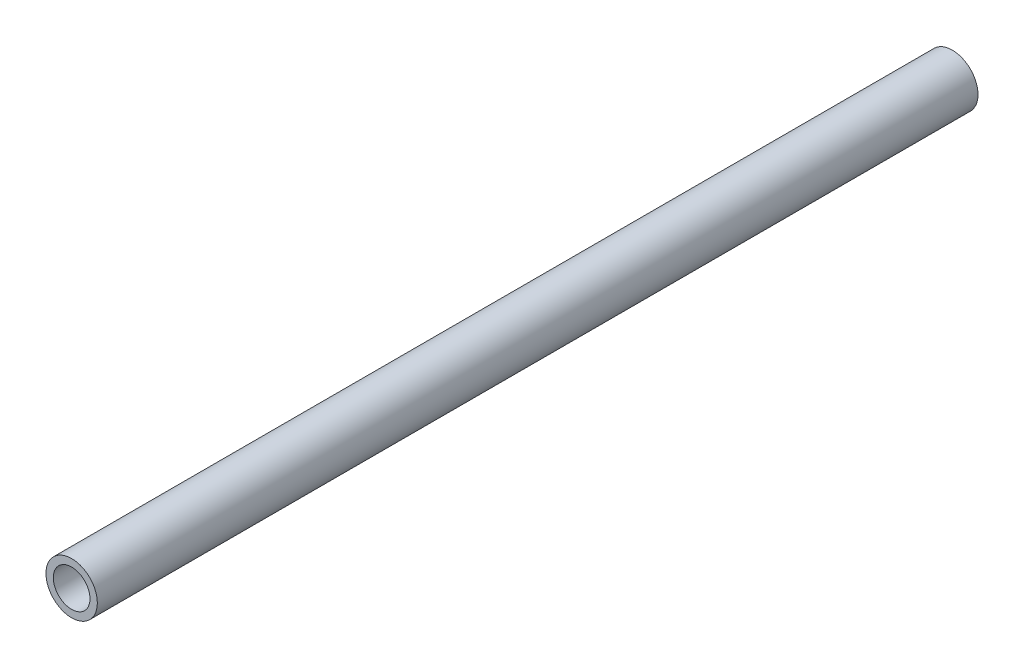
ISO-10303-21;
HEADER;
FILE_DESCRIPTION(('STEP AP214'),'2;1');
FILE_NAME('part.step','',(''),(''),'','','');
FILE_SCHEMA(('AUTOMOTIVE_DESIGN { 1 0 10303 214 1 1 1 1 }'));
ENDSEC;
DATA;
#1=APPLICATION_CONTEXT('core data for automotive mechanical design processes');
#2=APPLICATION_PROTOCOL_DEFINITION('international standard','automotive_design',2000,#1);
#3=PRODUCT_CONTEXT('',#1,'mechanical');
#4=PRODUCT('Part','Part','',(#3));
#5=PRODUCT_RELATED_PRODUCT_CATEGORY('part','',(#4));
#6=PRODUCT_DEFINITION_FORMATION('','',#4);
#7=PRODUCT_DEFINITION_CONTEXT('part definition',#1,'design');
#8=PRODUCT_DEFINITION('design','',#6,#7);
#9=PRODUCT_DEFINITION_SHAPE('','',#8);
#10=(LENGTH_UNIT() NAMED_UNIT(*) SI_UNIT(.MILLI.,.METRE.));
#11=(NAMED_UNIT(*) PLANE_ANGLE_UNIT() SI_UNIT($,.RADIAN.));
#12=(NAMED_UNIT(*) SI_UNIT($,.STERADIAN.) SOLID_ANGLE_UNIT());
#13=UNCERTAINTY_MEASURE_WITH_UNIT(LENGTH_MEASURE(1.E-05),#10,'distance_accuracy_value','');
#14=(GEOMETRIC_REPRESENTATION_CONTEXT(3) GLOBAL_UNCERTAINTY_ASSIGNED_CONTEXT((#13)) GLOBAL_UNIT_ASSIGNED_CONTEXT((#10,
#11,#12)) REPRESENTATION_CONTEXT('',''));
#15=CARTESIAN_POINT('',(0.,0.,0.));
#16=DIRECTION('',(0.,0.,1.));
#17=DIRECTION('',(1.,0.,0.));
#18=AXIS2_PLACEMENT_3D('',#15,#16,#17);
#19=CARTESIAN_POINT('',(0.,0.,457.2));
#20=DIRECTION('',(0.,0.,-1.));
#21=DIRECTION('',(-1.,0.,0.));
#22=AXIS2_PLACEMENT_3D('',#19,#20,#21);
#23=CYLINDRICAL_SURFACE('',#22,13.335);
#24=CARTESIAN_POINT('',(0.,0.,457.2));
#25=DIRECTION('',(0.,0.,1.));
#26=DIRECTION('',(1.,0.,0.));
#27=AXIS2_PLACEMENT_3D('',#24,#25,#26);
#28=CIRCLE('',#27,13.335);
#29=CARTESIAN_POINT('',(13.335,0.,457.2));
#30=VERTEX_POINT('',#29);
#31=EDGE_CURVE('E10',#30,#30,#28,.T.);
#32=ORIENTED_EDGE('',*,*,#31,.F.);
#33=EDGE_LOOP('',(#32));
#34=FACE_BOUND('',#33,.T.);
#35=CARTESIAN_POINT('',(0.,0.,0.));
#36=DIRECTION('',(0.,0.,1.));
#37=DIRECTION('',(1.,0.,0.));
#38=AXIS2_PLACEMENT_3D('',#35,#36,#37);
#39=CIRCLE('',#38,13.335);
#40=CARTESIAN_POINT('',(13.335,0.,0.));
#41=VERTEX_POINT('',#40);
#42=EDGE_CURVE('E34',#41,#41,#39,.T.);
#43=ORIENTED_EDGE('',*,*,#42,.T.);
#44=EDGE_LOOP('',(#43));
#45=FACE_BOUND('',#44,.T.);
#46=ADVANCED_FACE('F31',(#34,#45),#23,.T.);
#47=CARTESIAN_POINT('',(0.,0.,457.2));
#48=DIRECTION('',(0.,0.,1.));
#49=DIRECTION('',(1.,0.,0.));
#50=AXIS2_PLACEMENT_3D('',#47,#48,#49);
#51=PLANE('',#50);
#52=CARTESIAN_POINT('',(0.,0.,457.2));
#53=DIRECTION('',(0.,0.,-1.));
#54=DIRECTION('',(-1.,0.,0.));
#55=AXIS2_PLACEMENT_3D('',#52,#53,#54);
#56=CIRCLE('',#55,9.525);
#57=CARTESIAN_POINT('',(-9.525,0.,457.2));
#58=VERTEX_POINT('',#57);
#59=EDGE_CURVE('E41',#58,#58,#56,.T.);
#60=ORIENTED_EDGE('',*,*,#59,.T.);
#61=EDGE_LOOP('',(#60));
#62=FACE_BOUND('',#61,.T.);
#63=ORIENTED_EDGE('',*,*,#31,.T.);
#64=EDGE_LOOP('',(#63));
#65=FACE_BOUND('',#64,.T.);
#66=ADVANCED_FACE('F49',(#62,#65),#51,.T.);
#67=CARTESIAN_POINT('',(0.,0.,0.));
#68=DIRECTION('',(0.,0.,1.));
#69=DIRECTION('',(1.,0.,0.));
#70=AXIS2_PLACEMENT_3D('',#67,#68,#69);
#71=PLANE('',#70);
#72=CARTESIAN_POINT('',(0.,0.,0.));
#73=DIRECTION('',(0.,0.,-1.));
#74=DIRECTION('',(-1.,0.,0.));
#75=AXIS2_PLACEMENT_3D('',#72,#73,#74);
#76=CIRCLE('',#75,9.525);
#77=CARTESIAN_POINT('',(-9.525,0.,0.));
#78=VERTEX_POINT('',#77);
#79=EDGE_CURVE('E43',#78,#78,#76,.T.);
#80=ORIENTED_EDGE('',*,*,#79,.F.);
#81=EDGE_LOOP('',(#80));
#82=FACE_BOUND('',#81,.T.);
#83=ORIENTED_EDGE('',*,*,#42,.F.);
#84=EDGE_LOOP('',(#83));
#85=FACE_BOUND('',#84,.T.);
#86=ADVANCED_FACE('F54',(#82,#85),#71,.F.);
#87=CARTESIAN_POINT('',(0.,0.,457.2));
#88=DIRECTION('',(0.,0.,-1.));
#89=DIRECTION('',(-1.,0.,0.));
#90=AXIS2_PLACEMENT_3D('',#87,#88,#89);
#91=CYLINDRICAL_SURFACE('',#90,9.525);
#92=ORIENTED_EDGE('',*,*,#59,.F.);
#93=EDGE_LOOP('',(#92));
#94=FACE_BOUND('',#93,.T.);
#95=ORIENTED_EDGE('',*,*,#79,.T.);
#96=EDGE_LOOP('',(#95));
#97=FACE_BOUND('',#96,.T.);
#98=ADVANCED_FACE('F51',(#94,#97),#91,.F.);
#99=CLOSED_SHELL('',(#46,#66,#86,#98));
#100=MANIFOLD_SOLID_BREP('B2',#99);
#101=ADVANCED_BREP_SHAPE_REPRESENTATION('',(#18,#100),#14);
#102=SHAPE_DEFINITION_REPRESENTATION(#9,#101);
ENDSEC;
END-ISO-10303-21;
